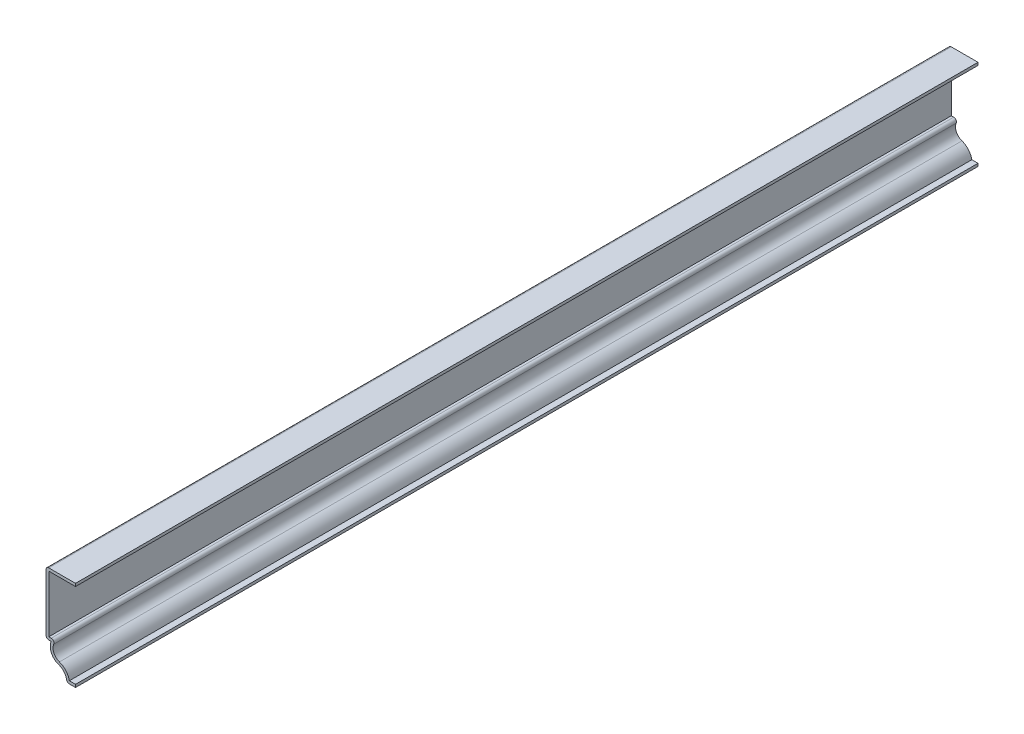
ISO-10303-21;
HEADER;
FILE_DESCRIPTION(('STEP AP214'),'2;1');
FILE_NAME('part.step','',(''),(''),'','','');
FILE_SCHEMA(('AUTOMOTIVE_DESIGN { 1 0 10303 214 1 1 1 1 }'));
ENDSEC;
DATA;
#1=APPLICATION_CONTEXT('core data for automotive mechanical design processes');
#2=APPLICATION_PROTOCOL_DEFINITION('international standard','automotive_design',2000,#1);
#3=PRODUCT_CONTEXT('',#1,'mechanical');
#4=PRODUCT('Part','Part','',(#3));
#5=PRODUCT_RELATED_PRODUCT_CATEGORY('part','',(#4));
#6=PRODUCT_DEFINITION_FORMATION('','',#4);
#7=PRODUCT_DEFINITION_CONTEXT('part definition',#1,'design');
#8=PRODUCT_DEFINITION('design','',#6,#7);
#9=PRODUCT_DEFINITION_SHAPE('','',#8);
#10=(LENGTH_UNIT() NAMED_UNIT(*) SI_UNIT(.MILLI.,.METRE.));
#11=(NAMED_UNIT(*) PLANE_ANGLE_UNIT() SI_UNIT($,.RADIAN.));
#12=(NAMED_UNIT(*) SI_UNIT($,.STERADIAN.) SOLID_ANGLE_UNIT());
#13=UNCERTAINTY_MEASURE_WITH_UNIT(LENGTH_MEASURE(1.E-05),#10,'distance_accuracy_value','');
#14=(GEOMETRIC_REPRESENTATION_CONTEXT(3) GLOBAL_UNCERTAINTY_ASSIGNED_CONTEXT((#13)) GLOBAL_UNIT_ASSIGNED_CONTEXT((#10,
#11,#12)) REPRESENTATION_CONTEXT('',''));
#15=CARTESIAN_POINT('',(0.,0.,0.));
#16=DIRECTION('',(0.,0.,1.));
#17=DIRECTION('',(1.,0.,0.));
#18=AXIS2_PLACEMENT_3D('',#15,#16,#17);
#19=CARTESIAN_POINT('',(-13.49375,40.005,-412.75));
#20=DIRECTION('',(0.,-1.,0.));
#21=DIRECTION('',(0.,0.,-1.));
#22=AXIS2_PLACEMENT_3D('',#19,#20,#21);
#23=PLANE('',#22);
#24=DIRECTION('',(1.,0.,0.));
#25=VECTOR('',#24,1.);
#26=CARTESIAN_POINT('',(-13.49375,40.005,0.));
#27=LINE('',#26,#25);
#28=CARTESIAN_POINT('',(-12.22375,40.005,0.));
#29=VERTEX_POINT('',#28);
#30=CARTESIAN_POINT('',(0.,40.005,0.));
#31=VERTEX_POINT('',#30);
#32=EDGE_CURVE('E218',#29,#31,#27,.T.);
#33=ORIENTED_EDGE('',*,*,#32,.F.);
#34=DIRECTION('',(0.,0.,1.));
#35=VECTOR('',#34,1.);
#36=CARTESIAN_POINT('',(-12.22375,40.005,-412.75));
#37=LINE('',#36,#35);
#38=CARTESIAN_POINT('',(-12.22375,40.005,-412.75));
#39=VERTEX_POINT('',#38);
#40=EDGE_CURVE('E185',#39,#29,#37,.T.);
#41=ORIENTED_EDGE('',*,*,#40,.F.);
#42=DIRECTION('',(1.,0.,0.));
#43=VECTOR('',#42,1.);
#44=CARTESIAN_POINT('',(-13.49375,40.005,-412.75));
#45=LINE('',#44,#43);
#46=CARTESIAN_POINT('',(0.,40.005,-412.75));
#47=VERTEX_POINT('',#46);
#48=EDGE_CURVE('E167',#39,#47,#45,.T.);
#49=ORIENTED_EDGE('',*,*,#48,.T.);
#50=DIRECTION('',(0.,0.,1.));
#51=VECTOR('',#50,1.);
#52=CARTESIAN_POINT('',(0.,40.005,-412.75));
#53=LINE('',#52,#51);
#54=EDGE_CURVE('E175',#47,#31,#53,.T.);
#55=ORIENTED_EDGE('',*,*,#54,.T.);
#56=EDGE_LOOP('',(#33,#41,#49,#55));
#57=FACE_BOUND('',#56,.T.);
#58=ADVANCED_FACE('F35',(#57),#23,.T.);
#59=CARTESIAN_POINT('',(-12.22375,12.7,-412.75));
#60=DIRECTION('',(1.,0.,0.));
#61=DIRECTION('',(0.,0.,-1.));
#62=AXIS2_PLACEMENT_3D('',#59,#60,#61);
#63=PLANE('',#62);
#64=DIRECTION('',(0.,1.,0.));
#65=VECTOR('',#64,1.);
#66=CARTESIAN_POINT('',(-12.22375,12.7,0.));
#67=LINE('',#66,#65);
#68=CARTESIAN_POINT('',(-12.22375,13.97,0.));
#69=VERTEX_POINT('',#68);
#70=EDGE_CURVE('E186',#69,#29,#67,.T.);
#71=ORIENTED_EDGE('',*,*,#70,.F.);
#72=DIRECTION('',(0.,0.,1.));
#73=VECTOR('',#72,1.);
#74=CARTESIAN_POINT('',(-12.22375,13.97,-412.75));
#75=LINE('',#74,#73);
#76=CARTESIAN_POINT('',(-12.22375,13.97,-412.75));
#77=VERTEX_POINT('',#76);
#78=EDGE_CURVE('E249',#77,#69,#75,.T.);
#79=ORIENTED_EDGE('',*,*,#78,.F.);
#80=DIRECTION('',(0.,1.,0.));
#81=VECTOR('',#80,1.);
#82=CARTESIAN_POINT('',(-12.22375,12.7,-412.75));
#83=LINE('',#82,#81);
#84=EDGE_CURVE('E183',#77,#39,#83,.T.);
#85=ORIENTED_EDGE('',*,*,#84,.T.);
#86=ORIENTED_EDGE('',*,*,#40,.T.);
#87=EDGE_LOOP('',(#71,#79,#85,#86));
#88=FACE_BOUND('',#87,.T.);
#89=ADVANCED_FACE('F320',(#88),#63,.T.);
#90=CARTESIAN_POINT('',(-11.1125,13.97,-412.75));
#91=DIRECTION('',(0.,1.,0.));
#92=DIRECTION('',(-1.,0.,0.));
#93=AXIS2_PLACEMENT_3D('',#90,#91,#92);
#94=PLANE('',#93);
#95=DIRECTION('',(-1.,0.,0.));
#96=VECTOR('',#95,1.);
#97=CARTESIAN_POINT('',(-11.1125,13.97,0.));
#98=LINE('',#97,#96);
#99=CARTESIAN_POINT('',(-11.1125,13.97,0.));
#100=VERTEX_POINT('',#99);
#101=EDGE_CURVE('E189',#100,#69,#98,.T.);
#102=ORIENTED_EDGE('',*,*,#101,.F.);
#103=DIRECTION('',(0.,0.,1.));
#104=VECTOR('',#103,1.);
#105=CARTESIAN_POINT('',(-11.1125,13.97,-412.75));
#106=LINE('',#105,#104);
#107=CARTESIAN_POINT('',(-11.1125,13.97,-412.75));
#108=VERTEX_POINT('',#107);
#109=EDGE_CURVE('E290',#100,#108,#106,.F.);
#110=ORIENTED_EDGE('',*,*,#109,.T.);
#111=DIRECTION('',(-1.,0.,0.));
#112=VECTOR('',#111,1.);
#113=CARTESIAN_POINT('',(-11.1125,13.97,-412.75));
#114=LINE('',#113,#112);
#115=EDGE_CURVE('E215',#108,#77,#114,.T.);
#116=ORIENTED_EDGE('',*,*,#115,.T.);
#117=ORIENTED_EDGE('',*,*,#78,.T.);
#118=EDGE_LOOP('',(#102,#110,#116,#117));
#119=FACE_BOUND('',#118,.T.);
#120=ADVANCED_FACE('F374',(#119),#94,.T.);
#121=CARTESIAN_POINT('',(-5.99463989572972,10.5368028255338,-412.75));
#122=DIRECTION('',(0.,0.,1.));
#123=DIRECTION('',(1.,0.,0.));
#124=AXIS2_PLACEMENT_3D('',#121,#122,#123);
#125=CYLINDRICAL_SURFACE('',#124,4.28625);
#126=CARTESIAN_POINT('',(-5.99463989572972,10.5368028255338,-412.75));
#127=DIRECTION('',(0.,0.,1.));
#128=DIRECTION('',(1.,0.,0.));
#129=AXIS2_PLACEMENT_3D('',#126,#127,#128);
#130=CIRCLE('',#129,4.28625);
#131=CARTESIAN_POINT('',(-7.35635022166254,6.47260744997075,-412.75));
#132=VERTEX_POINT('',#131);
#133=CARTESIAN_POINT('',(-9.94270340473822,12.2055549315506,-412.75));
#134=VERTEX_POINT('',#133);
#135=EDGE_CURVE('E212',#132,#134,#130,.F.);
#136=ORIENTED_EDGE('',*,*,#135,.T.);
#137=DIRECTION('',(0.,0.,1.));
#138=VECTOR('',#137,1.);
#139=CARTESIAN_POINT('',(-9.94270340473822,12.2055549315506,-412.75));
#140=LINE('',#139,#138);
#141=CARTESIAN_POINT('',(-9.94270340473822,12.2055549315506,0.));
#142=VERTEX_POINT('',#141);
#143=EDGE_CURVE('E287',#134,#142,#140,.T.);
#144=ORIENTED_EDGE('',*,*,#143,.T.);
#145=CARTESIAN_POINT('',(-5.99463989572972,10.5368028255338,0.));
#146=DIRECTION('',(0.,0.,1.));
#147=DIRECTION('',(1.,0.,0.));
#148=AXIS2_PLACEMENT_3D('',#145,#146,#147);
#149=CIRCLE('',#148,4.28625);
#150=CARTESIAN_POINT('',(-7.35635022166254,6.47260744997075,0.));
#151=VERTEX_POINT('',#150);
#152=EDGE_CURVE('E243',#151,#142,#149,.F.);
#153=ORIENTED_EDGE('',*,*,#152,.F.);
#154=DIRECTION('',(0.,0.,1.));
#155=VECTOR('',#154,1.);
#156=CARTESIAN_POINT('',(-7.35635022166254,6.47260744997075,-412.75));
#157=LINE('',#156,#155);
#158=EDGE_CURVE('E252',#132,#151,#157,.T.);
#159=ORIENTED_EDGE('',*,*,#158,.F.);
#160=EDGE_LOOP('',(#136,#144,#153,#159));
#161=FACE_BOUND('',#160,.T.);
#162=ADVANCED_FACE('F331',(#161),#125,.F.);
#163=CARTESIAN_POINT('',(-9.525,0.,-412.75));
#164=DIRECTION('',(0.,0.,1.));
#165=DIRECTION('',(1.,0.,0.));
#166=AXIS2_PLACEMENT_3D('',#163,#164,#165);
#167=CYLINDRICAL_SURFACE('',#166,6.82625);
#168=CARTESIAN_POINT('',(-9.525,0.,0.));
#169=DIRECTION('',(0.,0.,1.));
#170=DIRECTION('',(1.,0.,0.));
#171=AXIS2_PLACEMENT_3D('',#168,#169,#170);
#172=CIRCLE('',#171,6.82625);
#173=CARTESIAN_POINT('',(-2.81792991966686,1.27,0.));
#174=VERTEX_POINT('',#173);
#175=EDGE_CURVE('E240',#174,#151,#172,.T.);
#176=ORIENTED_EDGE('',*,*,#175,.F.);
#177=DIRECTION('',(0.,0.,1.));
#178=VECTOR('',#177,1.);
#179=CARTESIAN_POINT('',(-2.81792991966686,1.27,-412.75));
#180=LINE('',#179,#178);
#181=CARTESIAN_POINT('',(-2.81792991966686,1.27,-412.75));
#182=VERTEX_POINT('',#181);
#183=EDGE_CURVE('E254',#182,#174,#180,.T.);
#184=ORIENTED_EDGE('',*,*,#183,.F.);
#185=CARTESIAN_POINT('',(-9.525,0.,-412.75));
#186=DIRECTION('',(0.,0.,1.));
#187=DIRECTION('',(1.,0.,0.));
#188=AXIS2_PLACEMENT_3D('',#185,#186,#187);
#189=CIRCLE('',#188,6.82625);
#190=EDGE_CURVE('E209',#182,#132,#189,.T.);
#191=ORIENTED_EDGE('',*,*,#190,.T.);
#192=ORIENTED_EDGE('',*,*,#158,.T.);
#193=EDGE_LOOP('',(#176,#184,#191,#192));
#194=FACE_BOUND('',#193,.T.);
#195=ADVANCED_FACE('F336',(#194),#167,.T.);
#196=CARTESIAN_POINT('',(0.,1.27,-412.75));
#197=DIRECTION('',(0.,1.,0.));
#198=DIRECTION('',(0.,0.,1.));
#199=AXIS2_PLACEMENT_3D('',#196,#197,#198);
#200=PLANE('',#199);
#201=DIRECTION('',(1.,0.,0.));
#202=VECTOR('',#201,1.);
#203=CARTESIAN_POINT('',(0.,1.27,0.));
#204=LINE('',#203,#202);
#205=CARTESIAN_POINT('',(0.,1.27,0.));
#206=VERTEX_POINT('',#205);
#207=EDGE_CURVE('E237',#206,#174,#204,.F.);
#208=ORIENTED_EDGE('',*,*,#207,.F.);
#209=DIRECTION('',(0.,0.,1.));
#210=VECTOR('',#209,1.);
#211=CARTESIAN_POINT('',(0.,1.27,-412.75));
#212=LINE('',#211,#210);
#213=CARTESIAN_POINT('',(0.,1.27,-412.75));
#214=VERTEX_POINT('',#213);
#215=EDGE_CURVE('E256',#214,#206,#212,.T.);
#216=ORIENTED_EDGE('',*,*,#215,.F.);
#217=DIRECTION('',(1.,0.,0.));
#218=VECTOR('',#217,1.);
#219=CARTESIAN_POINT('',(0.,1.27,-412.75));
#220=LINE('',#219,#218);
#221=EDGE_CURVE('E206',#214,#182,#220,.F.);
#222=ORIENTED_EDGE('',*,*,#221,.T.);
#223=ORIENTED_EDGE('',*,*,#183,.T.);
#224=EDGE_LOOP('',(#208,#216,#222,#223));
#225=FACE_BOUND('',#224,.T.);
#226=ADVANCED_FACE('F340',(#225),#200,.T.);
#227=CARTESIAN_POINT('',(0.,1.27,-412.75));
#228=DIRECTION('',(-1.,0.,0.));
#229=DIRECTION('',(0.,0.,1.));
#230=AXIS2_PLACEMENT_3D('',#227,#228,#229);
#231=PLANE('',#230);
#232=DIRECTION('',(0.,-1.,0.));
#233=VECTOR('',#232,1.);
#234=CARTESIAN_POINT('',(0.,1.27,0.));
#235=LINE('',#234,#233);
#236=CARTESIAN_POINT('',(0.,0.,0.));
#237=VERTEX_POINT('',#236);
#238=EDGE_CURVE('E235',#206,#237,#235,.T.);
#239=ORIENTED_EDGE('',*,*,#238,.T.);
#240=DIRECTION('',(0.,0.,1.));
#241=VECTOR('',#240,1.);
#242=CARTESIAN_POINT('',(0.,0.,-412.75));
#243=LINE('',#242,#241);
#244=CARTESIAN_POINT('',(0.,0.,-412.75));
#245=VERTEX_POINT('',#244);
#246=EDGE_CURVE('E258',#245,#237,#243,.T.);
#247=ORIENTED_EDGE('',*,*,#246,.F.);
#248=DIRECTION('',(0.,-1.,0.));
#249=VECTOR('',#248,1.);
#250=CARTESIAN_POINT('',(0.,1.27,-412.75));
#251=LINE('',#250,#249);
#252=EDGE_CURVE('E204',#214,#245,#251,.T.);
#253=ORIENTED_EDGE('',*,*,#252,.F.);
#254=ORIENTED_EDGE('',*,*,#215,.T.);
#255=EDGE_LOOP('',(#239,#247,#253,#254));
#256=FACE_BOUND('',#255,.T.);
#257=ADVANCED_FACE('F344',(#256),#231,.F.);
#258=CARTESIAN_POINT('',(0.,0.,-412.75));
#259=DIRECTION('',(0.,1.,0.));
#260=DIRECTION('',(0.,0.,1.));
#261=AXIS2_PLACEMENT_3D('',#258,#259,#260);
#262=PLANE('',#261);
#263=DIRECTION('',(-1.,0.,0.));
#264=VECTOR('',#263,1.);
#265=CARTESIAN_POINT('',(0.,0.,0.));
#266=LINE('',#265,#264);
#267=CARTESIAN_POINT('',(-2.81792991966686,0.,0.));
#268=VERTEX_POINT('',#267);
#269=EDGE_CURVE('E232',#237,#268,#266,.T.);
#270=ORIENTED_EDGE('',*,*,#269,.T.);
#271=DIRECTION('',(0.,0.,1.));
#272=VECTOR('',#271,1.);
#273=CARTESIAN_POINT('',(-2.81792991966686,0.,-412.75));
#274=LINE('',#273,#272);
#275=CARTESIAN_POINT('',(-2.81792991966686,0.,-412.75));
#276=VERTEX_POINT('',#275);
#277=EDGE_CURVE('E278',#268,#276,#274,.F.);
#278=ORIENTED_EDGE('',*,*,#277,.T.);
#279=DIRECTION('',(-1.,0.,0.));
#280=VECTOR('',#279,1.);
#281=CARTESIAN_POINT('',(0.,0.,-412.75));
#282=LINE('',#281,#280);
#283=EDGE_CURVE('E202',#245,#276,#282,.T.);
#284=ORIENTED_EDGE('',*,*,#283,.F.);
#285=ORIENTED_EDGE('',*,*,#246,.T.);
#286=EDGE_LOOP('',(#270,#278,#284,#285));
#287=FACE_BOUND('',#286,.T.);
#288=ADVANCED_FACE('F367',(#287),#262,.F.);
#289=CARTESIAN_POINT('',(-9.525,0.,-412.75));
#290=DIRECTION('',(0.,0.,1.));
#291=DIRECTION('',(1.,0.,0.));
#292=AXIS2_PLACEMENT_3D('',#289,#290,#291);
#293=CYLINDRICAL_SURFACE('',#292,5.55625);
#294=CARTESIAN_POINT('',(-9.525,0.,-412.75));
#295=DIRECTION('',(0.,0.,1.));
#296=DIRECTION('',(1.,0.,0.));
#297=AXIS2_PLACEMENT_3D('',#294,#295,#296);
#298=CIRCLE('',#297,5.55625);
#299=CARTESIAN_POINT('',(-4.06575691135675,1.03372093023256,-412.75));
#300=VERTEX_POINT('',#299);
#301=CARTESIAN_POINT('',(-7.75981994786486,5.26840141276689,-412.75));
#302=VERTEX_POINT('',#301);
#303=EDGE_CURVE('E200',#300,#302,#298,.T.);
#304=ORIENTED_EDGE('',*,*,#303,.F.);
#305=DIRECTION('',(0.,0.,1.));
#306=VECTOR('',#305,1.);
#307=CARTESIAN_POINT('',(-4.06575691135675,1.03372093023256,-412.75));
#308=LINE('',#307,#306);
#309=CARTESIAN_POINT('',(-4.06575691135675,1.03372093023256,0.));
#310=VERTEX_POINT('',#309);
#311=EDGE_CURVE('E248',#300,#310,#308,.T.);
#312=ORIENTED_EDGE('',*,*,#311,.T.);
#313=CARTESIAN_POINT('',(-9.525,0.,0.));
#314=DIRECTION('',(0.,0.,1.));
#315=DIRECTION('',(1.,0.,0.));
#316=AXIS2_PLACEMENT_3D('',#313,#314,#315);
#317=CIRCLE('',#316,5.55625);
#318=CARTESIAN_POINT('',(-7.75981994786486,5.26840141276689,0.));
#319=VERTEX_POINT('',#318);
#320=EDGE_CURVE('E230',#310,#319,#317,.T.);
#321=ORIENTED_EDGE('',*,*,#320,.T.);
#322=DIRECTION('',(0.,0.,1.));
#323=VECTOR('',#322,1.);
#324=CARTESIAN_POINT('',(-7.75981994786486,5.26840141276689,-412.75));
#325=LINE('',#324,#323);
#326=EDGE_CURVE('E261',#302,#319,#325,.T.);
#327=ORIENTED_EDGE('',*,*,#326,.F.);
#328=EDGE_LOOP('',(#304,#312,#321,#327));
#329=FACE_BOUND('',#328,.T.);
#330=ADVANCED_FACE('F354',(#329),#293,.F.);
#331=CARTESIAN_POINT('',(-5.99463989572972,10.5368028255338,-412.75));
#332=DIRECTION('',(0.,0.,1.));
#333=DIRECTION('',(1.,0.,0.));
#334=AXIS2_PLACEMENT_3D('',#331,#332,#333);
#335=CYLINDRICAL_SURFACE('',#334,5.55625);
#336=CARTESIAN_POINT('',(-5.99463989572972,10.5368028255338,0.));
#337=DIRECTION('',(0.,0.,-1.));
#338=DIRECTION('',(-1.,0.,0.));
#339=AXIS2_PLACEMENT_3D('',#336,#337,#338);
#340=CIRCLE('',#339,5.55625);
#341=CARTESIAN_POINT('',(-11.1125,12.7,0.));
#342=VERTEX_POINT('',#341);
#343=EDGE_CURVE('E228',#319,#342,#340,.T.);
#344=ORIENTED_EDGE('',*,*,#343,.T.);
#345=DIRECTION('',(0.,0.,1.));
#346=VECTOR('',#345,1.);
#347=CARTESIAN_POINT('',(-11.1125,12.7,-412.75));
#348=LINE('',#347,#346);
#349=CARTESIAN_POINT('',(-11.1125,12.7,-412.75));
#350=VERTEX_POINT('',#349);
#351=EDGE_CURVE('E264',#350,#342,#348,.T.);
#352=ORIENTED_EDGE('',*,*,#351,.F.);
#353=CARTESIAN_POINT('',(-5.99463989572972,10.5368028255338,-412.75));
#354=DIRECTION('',(0.,0.,-1.));
#355=DIRECTION('',(-1.,0.,0.));
#356=AXIS2_PLACEMENT_3D('',#353,#354,#355);
#357=CIRCLE('',#356,5.55625);
#358=EDGE_CURVE('E198',#302,#350,#357,.T.);
#359=ORIENTED_EDGE('',*,*,#358,.F.);
#360=ORIENTED_EDGE('',*,*,#326,.T.);
#361=EDGE_LOOP('',(#344,#352,#359,#360));
#362=FACE_BOUND('',#361,.T.);
#363=ADVANCED_FACE('F359',(#362),#335,.T.);
#364=CARTESIAN_POINT('',(-11.1125,12.7,-412.75));
#365=DIRECTION('',(0.,1.,0.));
#366=DIRECTION('',(-1.,0.,0.));
#367=AXIS2_PLACEMENT_3D('',#364,#365,#366);
#368=PLANE('',#367);
#369=DIRECTION('',(-1.,0.,0.));
#370=VECTOR('',#369,1.);
#371=CARTESIAN_POINT('',(-11.1125,12.7,0.));
#372=LINE('',#371,#370);
#373=CARTESIAN_POINT('',(-12.22375,12.7,0.));
#374=VERTEX_POINT('',#373);
#375=EDGE_CURVE('E225',#342,#374,#372,.T.);
#376=ORIENTED_EDGE('',*,*,#375,.T.);
#377=DIRECTION('',(0.,0.,1.));
#378=VECTOR('',#377,1.);
#379=CARTESIAN_POINT('',(-12.22375,12.7,-412.75));
#380=LINE('',#379,#378);
#381=CARTESIAN_POINT('',(-12.22375,12.7,-412.75));
#382=VERTEX_POINT('',#381);
#383=EDGE_CURVE('E43',#374,#382,#380,.F.);
#384=ORIENTED_EDGE('',*,*,#383,.T.);
#385=DIRECTION('',(-1.,0.,0.));
#386=VECTOR('',#385,1.);
#387=CARTESIAN_POINT('',(-11.1125,12.7,-412.75));
#388=LINE('',#387,#386);
#389=EDGE_CURVE('E195',#350,#382,#388,.T.);
#390=ORIENTED_EDGE('',*,*,#389,.F.);
#391=ORIENTED_EDGE('',*,*,#351,.T.);
#392=EDGE_LOOP('',(#376,#384,#390,#391));
#393=FACE_BOUND('',#392,.T.);
#394=ADVANCED_FACE('F298',(#393),#368,.F.);
#395=CARTESIAN_POINT('',(-13.49375,12.7,-412.75));
#396=DIRECTION('',(1.,0.,0.));
#397=DIRECTION('',(0.,0.,-1.));
#398=AXIS2_PLACEMENT_3D('',#395,#396,#397);
#399=PLANE('',#398);
#400=DIRECTION('',(0.,1.,0.));
#401=VECTOR('',#400,1.);
#402=CARTESIAN_POINT('',(-13.49375,12.7,-412.75));
#403=LINE('',#402,#401);
#404=CARTESIAN_POINT('',(-13.49375,13.97,-412.75));
#405=VERTEX_POINT('',#404);
#406=CARTESIAN_POINT('',(-13.49375,40.005,-412.75));
#407=VERTEX_POINT('',#406);
#408=EDGE_CURVE('E193',#405,#407,#403,.T.);
#409=ORIENTED_EDGE('',*,*,#408,.F.);
#410=DIRECTION('',(0.,0.,1.));
#411=VECTOR('',#410,1.);
#412=CARTESIAN_POINT('',(-13.49375,13.97,-412.75));
#413=LINE('',#412,#411);
#414=CARTESIAN_POINT('',(-13.49375,13.97,0.));
#415=VERTEX_POINT('',#414);
#416=EDGE_CURVE('E293',#405,#415,#413,.T.);
#417=ORIENTED_EDGE('',*,*,#416,.T.);
#418=DIRECTION('',(0.,1.,0.));
#419=VECTOR('',#418,1.);
#420=CARTESIAN_POINT('',(-13.49375,12.7,0.));
#421=LINE('',#420,#419);
#422=CARTESIAN_POINT('',(-13.49375,40.005,0.));
#423=VERTEX_POINT('',#422);
#424=EDGE_CURVE('E223',#415,#423,#421,.T.);
#425=ORIENTED_EDGE('',*,*,#424,.T.);
#426=DIRECTION('',(0.,0.,1.));
#427=VECTOR('',#426,1.);
#428=CARTESIAN_POINT('',(-13.49375,40.005,-412.75));
#429=LINE('',#428,#427);
#430=EDGE_CURVE('E58',#423,#407,#429,.F.);
#431=ORIENTED_EDGE('',*,*,#430,.T.);
#432=EDGE_LOOP('',(#409,#417,#425,#431));
#433=FACE_BOUND('',#432,.T.);
#434=ADVANCED_FACE('F307',(#433),#399,.F.);
#435=CARTESIAN_POINT('',(-13.49375,41.275,-412.75));
#436=DIRECTION('',(0.,-1.,0.));
#437=DIRECTION('',(0.,0.,-1.));
#438=AXIS2_PLACEMENT_3D('',#435,#436,#437);
#439=PLANE('',#438);
#440=DIRECTION('',(1.,0.,0.));
#441=VECTOR('',#440,1.);
#442=CARTESIAN_POINT('',(-13.49375,41.275,-412.75));
#443=LINE('',#442,#441);
#444=CARTESIAN_POINT('',(-12.22375,41.275,-412.75));
#445=VERTEX_POINT('',#444);
#446=CARTESIAN_POINT('',(0.,41.275,-412.75));
#447=VERTEX_POINT('',#446);
#448=EDGE_CURVE('E169',#445,#447,#443,.T.);
#449=ORIENTED_EDGE('',*,*,#448,.F.);
#450=DIRECTION('',(0.,0.,1.));
#451=VECTOR('',#450,1.);
#452=CARTESIAN_POINT('',(-12.22375,41.275,-412.75));
#453=LINE('',#452,#451);
#454=CARTESIAN_POINT('',(-12.22375,41.275,0.));
#455=VERTEX_POINT('',#454);
#456=EDGE_CURVE('E11',#445,#455,#453,.T.);
#457=ORIENTED_EDGE('',*,*,#456,.T.);
#458=DIRECTION('',(1.,0.,0.));
#459=VECTOR('',#458,1.);
#460=CARTESIAN_POINT('',(-13.49375,41.275,0.));
#461=LINE('',#460,#459);
#462=CARTESIAN_POINT('',(0.,41.275,0.));
#463=VERTEX_POINT('',#462);
#464=EDGE_CURVE('E221',#455,#463,#461,.T.);
#465=ORIENTED_EDGE('',*,*,#464,.T.);
#466=DIRECTION('',(0.,0.,1.));
#467=VECTOR('',#466,1.);
#468=CARTESIAN_POINT('',(0.,41.275,-412.75));
#469=LINE('',#468,#467);
#470=EDGE_CURVE('E182',#447,#463,#469,.T.);
#471=ORIENTED_EDGE('',*,*,#470,.F.);
#472=EDGE_LOOP('',(#449,#457,#465,#471));
#473=FACE_BOUND('',#472,.T.);
#474=ADVANCED_FACE('F315',(#473),#439,.F.);
#475=CARTESIAN_POINT('',(0.,41.275,-412.75));
#476=DIRECTION('',(-1.,0.,0.));
#477=DIRECTION('',(0.,0.,1.));
#478=AXIS2_PLACEMENT_3D('',#475,#476,#477);
#479=PLANE('',#478);
#480=DIRECTION('',(0.,-1.,0.));
#481=VECTOR('',#480,1.);
#482=CARTESIAN_POINT('',(0.,41.275,0.));
#483=LINE('',#482,#481);
#484=EDGE_CURVE('E178',#463,#31,#483,.T.);
#485=ORIENTED_EDGE('',*,*,#484,.T.);
#486=ORIENTED_EDGE('',*,*,#54,.F.);
#487=DIRECTION('',(0.,-1.,0.));
#488=VECTOR('',#487,1.);
#489=CARTESIAN_POINT('',(0.,41.275,-412.75));
#490=LINE('',#489,#488);
#491=EDGE_CURVE('E161',#447,#47,#490,.T.);
#492=ORIENTED_EDGE('',*,*,#491,.F.);
#493=ORIENTED_EDGE('',*,*,#470,.T.);
#494=EDGE_LOOP('',(#485,#486,#492,#493));
#495=FACE_BOUND('',#494,.T.);
#496=ADVANCED_FACE('F176',(#495),#479,.F.);
#497=CARTESIAN_POINT('',(-5.99463989572972,10.5368028255338,-412.75));
#498=DIRECTION('',(0.,0.,-1.));
#499=DIRECTION('',(-1.,0.,0.));
#500=AXIS2_PLACEMENT_3D('',#497,#498,#499);
#501=PLANE('',#500);
#502=ORIENTED_EDGE('',*,*,#283,.T.);
#503=CARTESIAN_POINT('',(-2.81792991966686,1.27,-412.75));
#504=DIRECTION('',(0.,0.,-1.));
#505=DIRECTION('',(-1.,0.,0.));
#506=AXIS2_PLACEMENT_3D('',#503,#504,#505);
#507=CIRCLE('',#506,1.27);
#508=EDGE_CURVE('E285',#276,#300,#507,.T.);
#509=ORIENTED_EDGE('',*,*,#508,.T.);
#510=ORIENTED_EDGE('',*,*,#303,.T.);
#511=ORIENTED_EDGE('',*,*,#358,.T.);
#512=ORIENTED_EDGE('',*,*,#389,.T.);
#513=CARTESIAN_POINT('',(-12.22375,13.97,-412.75));
#514=DIRECTION('',(0.,0.,-1.));
#515=DIRECTION('',(-1.,0.,0.));
#516=AXIS2_PLACEMENT_3D('',#513,#514,#515);
#517=CIRCLE('',#516,1.27);
#518=EDGE_CURVE('E281',#382,#405,#517,.T.);
#519=ORIENTED_EDGE('',*,*,#518,.T.);
#520=ORIENTED_EDGE('',*,*,#408,.T.);
#521=CARTESIAN_POINT('',(-12.22375,40.005,-412.75));
#522=DIRECTION('',(0.,0.,-1.));
#523=DIRECTION('',(-1.,0.,0.));
#524=AXIS2_PLACEMENT_3D('',#521,#522,#523);
#525=CIRCLE('',#524,1.27);
#526=EDGE_CURVE('E50',#407,#445,#525,.T.);
#527=ORIENTED_EDGE('',*,*,#526,.T.);
#528=ORIENTED_EDGE('',*,*,#448,.T.);
#529=ORIENTED_EDGE('',*,*,#491,.T.);
#530=ORIENTED_EDGE('',*,*,#48,.F.);
#531=ORIENTED_EDGE('',*,*,#84,.F.);
#532=ORIENTED_EDGE('',*,*,#115,.F.);
#533=CARTESIAN_POINT('',(-11.1125,12.7,-412.75));
#534=DIRECTION('',(0.,0.,-1.));
#535=DIRECTION('',(-1.,0.,0.));
#536=AXIS2_PLACEMENT_3D('',#533,#534,#535);
#537=CIRCLE('',#536,1.27);
#538=EDGE_CURVE('E283',#108,#134,#537,.T.);
#539=ORIENTED_EDGE('',*,*,#538,.T.);
#540=ORIENTED_EDGE('',*,*,#135,.F.);
#541=ORIENTED_EDGE('',*,*,#190,.F.);
#542=ORIENTED_EDGE('',*,*,#221,.F.);
#543=ORIENTED_EDGE('',*,*,#252,.T.);
#544=EDGE_LOOP('',(#502,#509,#510,#511,#512,#519,#520,#527,#528,#529,#530,#531,#532,#539,#540,
#541,#542,#543));
#545=FACE_BOUND('',#544,.T.);
#546=ADVANCED_FACE('F164',(#545),#501,.T.);
#547=CARTESIAN_POINT('',(-5.99463989572972,10.5368028255338,0.));
#548=DIRECTION('',(0.,0.,-1.));
#549=DIRECTION('',(-1.,0.,0.));
#550=AXIS2_PLACEMENT_3D('',#547,#548,#549);
#551=PLANE('',#550);
#552=ORIENTED_EDGE('',*,*,#320,.F.);
#553=CARTESIAN_POINT('',(-2.81792991966686,1.27,0.));
#554=DIRECTION('',(0.,0.,-1.));
#555=DIRECTION('',(-1.,0.,0.));
#556=AXIS2_PLACEMENT_3D('',#553,#554,#555);
#557=CIRCLE('',#556,1.27);
#558=EDGE_CURVE('E276',#310,#268,#557,.F.);
#559=ORIENTED_EDGE('',*,*,#558,.T.);
#560=ORIENTED_EDGE('',*,*,#269,.F.);
#561=ORIENTED_EDGE('',*,*,#238,.F.);
#562=ORIENTED_EDGE('',*,*,#207,.T.);
#563=ORIENTED_EDGE('',*,*,#175,.T.);
#564=ORIENTED_EDGE('',*,*,#152,.T.);
#565=CARTESIAN_POINT('',(-11.1125,12.7,0.));
#566=DIRECTION('',(0.,0.,-1.));
#567=DIRECTION('',(-1.,0.,0.));
#568=AXIS2_PLACEMENT_3D('',#565,#566,#567);
#569=CIRCLE('',#568,1.27);
#570=EDGE_CURVE('E274',#142,#100,#569,.F.);
#571=ORIENTED_EDGE('',*,*,#570,.T.);
#572=ORIENTED_EDGE('',*,*,#101,.T.);
#573=ORIENTED_EDGE('',*,*,#70,.T.);
#574=ORIENTED_EDGE('',*,*,#32,.T.);
#575=ORIENTED_EDGE('',*,*,#484,.F.);
#576=ORIENTED_EDGE('',*,*,#464,.F.);
#577=CARTESIAN_POINT('',(-12.22375,40.005,0.));
#578=DIRECTION('',(0.,0.,-1.));
#579=DIRECTION('',(-1.,0.,0.));
#580=AXIS2_PLACEMENT_3D('',#577,#578,#579);
#581=CIRCLE('',#580,1.27);
#582=EDGE_CURVE('E270',#455,#423,#581,.F.);
#583=ORIENTED_EDGE('',*,*,#582,.T.);
#584=ORIENTED_EDGE('',*,*,#424,.F.);
#585=CARTESIAN_POINT('',(-12.22375,13.97,0.));
#586=DIRECTION('',(0.,0.,-1.));
#587=DIRECTION('',(-1.,0.,0.));
#588=AXIS2_PLACEMENT_3D('',#585,#586,#587);
#589=CIRCLE('',#588,1.27);
#590=EDGE_CURVE('E272',#415,#374,#589,.F.);
#591=ORIENTED_EDGE('',*,*,#590,.T.);
#592=ORIENTED_EDGE('',*,*,#375,.F.);
#593=ORIENTED_EDGE('',*,*,#343,.F.);
#594=EDGE_LOOP('',(#552,#559,#560,#561,#562,#563,#564,#571,#572,#573,#574,#575,#576,#583,#584,
#591,#592,#593));
#595=FACE_BOUND('',#594,.T.);
#596=ADVANCED_FACE('F310',(#595),#551,.F.);
#597=CARTESIAN_POINT('',(-2.81792991966686,1.27,-412.75));
#598=DIRECTION('',(0.,0.,1.));
#599=DIRECTION('',(1.,0.,0.));
#600=AXIS2_PLACEMENT_3D('',#597,#598,#599);
#601=CYLINDRICAL_SURFACE('',#600,1.27);
#602=ORIENTED_EDGE('',*,*,#508,.F.);
#603=ORIENTED_EDGE('',*,*,#277,.F.);
#604=ORIENTED_EDGE('',*,*,#558,.F.);
#605=ORIENTED_EDGE('',*,*,#311,.F.);
#606=EDGE_LOOP('',(#602,#603,#604,#605));
#607=FACE_BOUND('',#606,.T.);
#608=ADVANCED_FACE('F352',(#607),#601,.T.);
#609=CARTESIAN_POINT('',(-11.1125,12.7,-412.75));
#610=DIRECTION('',(0.,0.,1.));
#611=DIRECTION('',(1.,0.,0.));
#612=AXIS2_PLACEMENT_3D('',#609,#610,#611);
#613=CYLINDRICAL_SURFACE('',#612,1.27);
#614=ORIENTED_EDGE('',*,*,#538,.F.);
#615=ORIENTED_EDGE('',*,*,#109,.F.);
#616=ORIENTED_EDGE('',*,*,#570,.F.);
#617=ORIENTED_EDGE('',*,*,#143,.F.);
#618=EDGE_LOOP('',(#614,#615,#616,#617));
#619=FACE_BOUND('',#618,.T.);
#620=ADVANCED_FACE('F328',(#619),#613,.T.);
#621=CARTESIAN_POINT('',(-12.22375,13.97,-412.75));
#622=DIRECTION('',(0.,0.,1.));
#623=DIRECTION('',(1.,0.,0.));
#624=AXIS2_PLACEMENT_3D('',#621,#622,#623);
#625=CYLINDRICAL_SURFACE('',#624,1.27);
#626=ORIENTED_EDGE('',*,*,#518,.F.);
#627=ORIENTED_EDGE('',*,*,#383,.F.);
#628=ORIENTED_EDGE('',*,*,#590,.F.);
#629=ORIENTED_EDGE('',*,*,#416,.F.);
#630=EDGE_LOOP('',(#626,#627,#628,#629));
#631=FACE_BOUND('',#630,.T.);
#632=ADVANCED_FACE('F305',(#631),#625,.T.);
#633=CARTESIAN_POINT('',(-12.22375,40.005,-412.75));
#634=DIRECTION('',(0.,0.,1.));
#635=DIRECTION('',(1.,0.,0.));
#636=AXIS2_PLACEMENT_3D('',#633,#634,#635);
#637=CYLINDRICAL_SURFACE('',#636,1.27);
#638=ORIENTED_EDGE('',*,*,#526,.F.);
#639=ORIENTED_EDGE('',*,*,#430,.F.);
#640=ORIENTED_EDGE('',*,*,#582,.F.);
#641=ORIENTED_EDGE('',*,*,#456,.F.);
#642=EDGE_LOOP('',(#638,#639,#640,#641));
#643=FACE_BOUND('',#642,.T.);
#644=ADVANCED_FACE('F37',(#643),#637,.T.);
#645=CLOSED_SHELL('',(#58,#89,#120,#162,#195,#226,#257,#288,#330,#363,#394,#434,#474,#496,#546,
#596,#608,#620,#632,#644));
#646=MANIFOLD_SOLID_BREP('B2',#645);
#647=ADVANCED_BREP_SHAPE_REPRESENTATION('',(#18,#646),#14);
#648=SHAPE_DEFINITION_REPRESENTATION(#9,#647);
ENDSEC;
END-ISO-10303-21;
